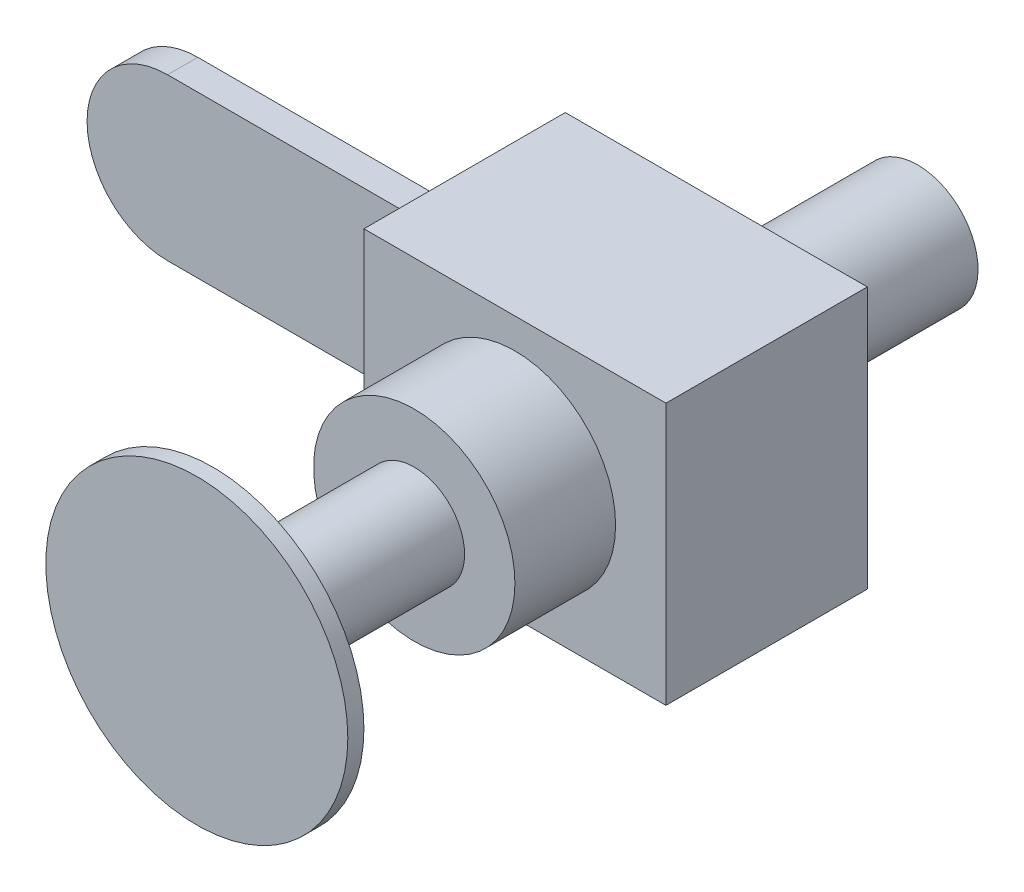
ISO-10303-21;
HEADER;
FILE_DESCRIPTION(('STEP AP214'),'2;1');
FILE_NAME('part.step','',(''),(''),'','','');
FILE_SCHEMA(('AUTOMOTIVE_DESIGN { 1 0 10303 214 1 1 1 1 }'));
ENDSEC;
DATA;
#1=APPLICATION_CONTEXT('core data for automotive mechanical design processes');
#2=APPLICATION_PROTOCOL_DEFINITION('international standard','automotive_design',2000,#1);
#3=PRODUCT_CONTEXT('',#1,'mechanical');
#4=PRODUCT('Part','Part','',(#3));
#5=PRODUCT_RELATED_PRODUCT_CATEGORY('part','',(#4));
#6=PRODUCT_DEFINITION_FORMATION('','',#4);
#7=PRODUCT_DEFINITION_CONTEXT('part definition',#1,'design');
#8=PRODUCT_DEFINITION('design','',#6,#7);
#9=PRODUCT_DEFINITION_SHAPE('','',#8);
#10=(LENGTH_UNIT() NAMED_UNIT(*) SI_UNIT(.MILLI.,.METRE.));
#11=(NAMED_UNIT(*) PLANE_ANGLE_UNIT() SI_UNIT($,.RADIAN.));
#12=(NAMED_UNIT(*) SI_UNIT($,.STERADIAN.) SOLID_ANGLE_UNIT());
#13=UNCERTAINTY_MEASURE_WITH_UNIT(LENGTH_MEASURE(1.E-05),#10,'distance_accuracy_value','');
#14=(GEOMETRIC_REPRESENTATION_CONTEXT(3) GLOBAL_UNCERTAINTY_ASSIGNED_CONTEXT((#13)) GLOBAL_UNIT_ASSIGNED_CONTEXT((#10,
#11,#12)) REPRESENTATION_CONTEXT('',''));
#15=CARTESIAN_POINT('',(0.,0.,0.));
#16=DIRECTION('',(0.,0.,1.));
#17=DIRECTION('',(1.,0.,0.));
#18=AXIS2_PLACEMENT_3D('',#15,#16,#17);
#19=CARTESIAN_POINT('',(0.,0.,7.5));
#20=DIRECTION('',(0.,0.,-1.));
#21=DIRECTION('',(-1.,0.,0.));
#22=AXIS2_PLACEMENT_3D('',#19,#20,#21);
#23=CYLINDRICAL_SURFACE('',#22,40.);
#24=CARTESIAN_POINT('',(0.,0.,-7.5));
#25=DIRECTION('',(0.,0.,1.));
#26=DIRECTION('',(1.,0.,0.));
#27=AXIS2_PLACEMENT_3D('',#24,#25,#26);
#28=CIRCLE('',#27,40.);
#29=CARTESIAN_POINT('',(0.,40.,-7.5));
#30=VERTEX_POINT('',#29);
#31=CARTESIAN_POINT('',(0.,-40.,-7.5));
#32=VERTEX_POINT('',#31);
#33=EDGE_CURVE('E136',#30,#32,#28,.T.);
#34=ORIENTED_EDGE('',*,*,#33,.T.);
#35=DIRECTION('',(0.,0.,-1.));
#36=VECTOR('',#35,1.);
#37=CARTESIAN_POINT('',(0.,-40.,7.5));
#38=LINE('',#37,#36);
#39=CARTESIAN_POINT('',(0.,-40.,7.5));
#40=VERTEX_POINT('',#39);
#41=EDGE_CURVE('E41',#40,#32,#38,.T.);
#42=ORIENTED_EDGE('',*,*,#41,.F.);
#43=CARTESIAN_POINT('',(0.,0.,7.5));
#44=DIRECTION('',(0.,0.,1.));
#45=DIRECTION('',(1.,0.,0.));
#46=AXIS2_PLACEMENT_3D('',#43,#44,#45);
#47=CIRCLE('',#46,40.);
#48=CARTESIAN_POINT('',(0.,40.,7.5));
#49=VERTEX_POINT('',#48);
#50=EDGE_CURVE('E145',#49,#40,#47,.T.);
#51=ORIENTED_EDGE('',*,*,#50,.F.);
#52=DIRECTION('',(0.,0.,-1.));
#53=VECTOR('',#52,1.);
#54=CARTESIAN_POINT('',(0.,40.,7.5));
#55=LINE('',#54,#53);
#56=EDGE_CURVE('E150',#49,#30,#55,.T.);
#57=ORIENTED_EDGE('',*,*,#56,.T.);
#58=EDGE_LOOP('',(#34,#42,#51,#57));
#59=FACE_BOUND('',#58,.T.);
#60=ADVANCED_FACE('F38',(#59),#23,.T.);
#61=CARTESIAN_POINT('',(140.,-40.,7.5));
#62=DIRECTION('',(0.,1.,0.));
#63=DIRECTION('',(-1.,0.,0.));
#64=AXIS2_PLACEMENT_3D('',#61,#62,#63);
#65=PLANE('',#64);
#66=DIRECTION('',(1.,0.,0.));
#67=VECTOR('',#66,1.);
#68=CARTESIAN_POINT('',(140.,-40.,-7.5));
#69=LINE('',#68,#67);
#70=CARTESIAN_POINT('',(140.,-40.,-7.5));
#71=VERTEX_POINT('',#70);
#72=EDGE_CURVE('E139',#32,#71,#69,.T.);
#73=ORIENTED_EDGE('',*,*,#72,.T.);
#74=DIRECTION('',(0.,0.,-1.));
#75=VECTOR('',#74,1.);
#76=CARTESIAN_POINT('',(140.,-40.,7.5));
#77=LINE('',#76,#75);
#78=CARTESIAN_POINT('',(140.,-40.,7.5));
#79=VERTEX_POINT('',#78);
#80=EDGE_CURVE('E159',#79,#71,#77,.T.);
#81=ORIENTED_EDGE('',*,*,#80,.F.);
#82=DIRECTION('',(1.,0.,0.));
#83=VECTOR('',#82,1.);
#84=CARTESIAN_POINT('',(140.,-40.,7.5));
#85=LINE('',#84,#83);
#86=EDGE_CURVE('E81',#40,#79,#85,.T.);
#87=ORIENTED_EDGE('',*,*,#86,.F.);
#88=ORIENTED_EDGE('',*,*,#41,.T.);
#89=EDGE_LOOP('',(#73,#81,#87,#88));
#90=FACE_BOUND('',#89,.T.);
#91=ADVANCED_FACE('F204',(#90),#65,.F.);
#92=CARTESIAN_POINT('',(0.,40.,7.5));
#93=DIRECTION('',(0.,-1.,0.));
#94=DIRECTION('',(1.,0.,0.));
#95=AXIS2_PLACEMENT_3D('',#92,#93,#94);
#96=PLANE('',#95);
#97=DIRECTION('',(-1.,0.,0.));
#98=VECTOR('',#97,1.);
#99=CARTESIAN_POINT('',(0.,40.,-7.5));
#100=LINE('',#99,#98);
#101=CARTESIAN_POINT('',(140.,40.,-7.5));
#102=VERTEX_POINT('',#101);
#103=EDGE_CURVE('E73',#102,#30,#100,.T.);
#104=ORIENTED_EDGE('',*,*,#103,.T.);
#105=ORIENTED_EDGE('',*,*,#56,.F.);
#106=DIRECTION('',(-1.,0.,0.));
#107=VECTOR('',#106,1.);
#108=CARTESIAN_POINT('',(0.,40.,7.5));
#109=LINE('',#108,#107);
#110=CARTESIAN_POINT('',(140.,40.,7.5));
#111=VERTEX_POINT('',#110);
#112=EDGE_CURVE('E56',#111,#49,#109,.T.);
#113=ORIENTED_EDGE('',*,*,#112,.F.);
#114=DIRECTION('',(0.,0.,-1.));
#115=VECTOR('',#114,1.);
#116=CARTESIAN_POINT('',(140.,40.,7.5));
#117=LINE('',#116,#115);
#118=EDGE_CURVE('E70',#111,#102,#117,.T.);
#119=ORIENTED_EDGE('',*,*,#118,.T.);
#120=EDGE_LOOP('',(#104,#105,#113,#119));
#121=FACE_BOUND('',#120,.T.);
#122=ADVANCED_FACE('F209',(#121),#96,.F.);
#123=CARTESIAN_POINT('',(0.,0.,7.5));
#124=DIRECTION('',(0.,0.,1.));
#125=DIRECTION('',(1.,0.,0.));
#126=AXIS2_PLACEMENT_3D('',#123,#124,#125);
#127=PLANE('',#126);
#128=ORIENTED_EDGE('',*,*,#50,.T.);
#129=ORIENTED_EDGE('',*,*,#86,.T.);
#130=DIRECTION('',(0.,1.,0.));
#131=VECTOR('',#130,1.);
#132=CARTESIAN_POINT('',(140.,40.,7.5));
#133=LINE('',#132,#131);
#134=EDGE_CURVE('E148',#79,#111,#133,.T.);
#135=ORIENTED_EDGE('',*,*,#134,.T.);
#136=ORIENTED_EDGE('',*,*,#112,.T.);
#137=EDGE_LOOP('',(#128,#129,#135,#136));
#138=FACE_BOUND('',#137,.T.);
#139=ADVANCED_FACE('F214',(#138),#127,.T.);
#140=CARTESIAN_POINT('',(0.,0.,-7.5));
#141=DIRECTION('',(0.,0.,1.));
#142=DIRECTION('',(1.,0.,0.));
#143=AXIS2_PLACEMENT_3D('',#140,#141,#142);
#144=PLANE('',#143);
#145=ORIENTED_EDGE('',*,*,#33,.F.);
#146=ORIENTED_EDGE('',*,*,#103,.F.);
#147=DIRECTION('',(0.,1.,0.));
#148=VECTOR('',#147,1.);
#149=CARTESIAN_POINT('',(140.,40.,-7.5));
#150=LINE('',#149,#148);
#151=EDGE_CURVE('E154',#71,#102,#150,.T.);
#152=ORIENTED_EDGE('',*,*,#151,.F.);
#153=ORIENTED_EDGE('',*,*,#72,.F.);
#154=EDGE_LOOP('',(#145,#146,#152,#153));
#155=FACE_BOUND('',#154,.T.);
#156=ADVANCED_FACE('F213',(#155),#144,.F.);
#157=CARTESIAN_POINT('',(140.,0.,0.));
#158=DIRECTION('',(1.,0.,0.));
#159=DIRECTION('',(0.,0.,-1.));
#160=AXIS2_PLACEMENT_3D('',#157,#158,#159);
#161=PLANE('',#160);
#162=DIRECTION('',(0.,1.,0.));
#163=VECTOR('',#162,1.);
#164=CARTESIAN_POINT('',(140.,65.,-50.));
#165=LINE('',#164,#163);
#166=CARTESIAN_POINT('',(140.,-65.,-50.));
#167=VERTEX_POINT('',#166);
#168=CARTESIAN_POINT('',(140.,65.,-50.));
#169=VERTEX_POINT('',#168);
#170=EDGE_CURVE('E135',#167,#169,#165,.T.);
#171=ORIENTED_EDGE('',*,*,#170,.F.);
#172=DIRECTION('',(0.,0.,-1.));
#173=VECTOR('',#172,1.);
#174=CARTESIAN_POINT('',(140.,-65.,50.));
#175=LINE('',#174,#173);
#176=CARTESIAN_POINT('',(140.,-65.,50.));
#177=VERTEX_POINT('',#176);
#178=EDGE_CURVE('E131',#177,#167,#175,.T.);
#179=ORIENTED_EDGE('',*,*,#178,.F.);
#180=DIRECTION('',(0.,-1.,0.));
#181=VECTOR('',#180,1.);
#182=CARTESIAN_POINT('',(140.,65.,50.));
#183=LINE('',#182,#181);
#184=CARTESIAN_POINT('',(140.,65.,50.));
#185=VERTEX_POINT('',#184);
#186=EDGE_CURVE('E180',#185,#177,#183,.T.);
#187=ORIENTED_EDGE('',*,*,#186,.F.);
#188=DIRECTION('',(0.,0.,1.));
#189=VECTOR('',#188,1.);
#190=CARTESIAN_POINT('',(140.,65.,50.));
#191=LINE('',#190,#189);
#192=EDGE_CURVE('E178',#169,#185,#191,.T.);
#193=ORIENTED_EDGE('',*,*,#192,.F.);
#194=EDGE_LOOP('',(#171,#179,#187,#193));
#195=FACE_BOUND('',#194,.T.);
#196=ORIENTED_EDGE('',*,*,#80,.T.);
#197=ORIENTED_EDGE('',*,*,#151,.T.);
#198=ORIENTED_EDGE('',*,*,#118,.F.);
#199=ORIENTED_EDGE('',*,*,#134,.F.);
#200=EDGE_LOOP('',(#196,#197,#198,#199));
#201=FACE_BOUND('',#200,.T.);
#202=ADVANCED_FACE('F191',(#195,#201),#161,.F.);
#203=CARTESIAN_POINT('',(290.,65.,-50.));
#204=DIRECTION('',(0.,0.,1.));
#205=DIRECTION('',(0.,-1.,0.));
#206=AXIS2_PLACEMENT_3D('',#203,#204,#205);
#207=PLANE('',#206);
#208=CARTESIAN_POINT('',(215.,0.,-50.));
#209=DIRECTION('',(0.,0.,-1.));
#210=DIRECTION('',(0.,1.,0.));
#211=AXIS2_PLACEMENT_3D('',#208,#209,#210);
#212=CIRCLE('',#211,30.);
#213=CARTESIAN_POINT('',(215.,30.,-50.));
#214=VERTEX_POINT('',#213);
#215=EDGE_CURVE('E163',#214,#214,#212,.T.);
#216=ORIENTED_EDGE('',*,*,#215,.F.);
#217=EDGE_LOOP('',(#216));
#218=FACE_BOUND('',#217,.T.);
#219=ORIENTED_EDGE('',*,*,#170,.T.);
#220=DIRECTION('',(-1.,0.,0.));
#221=VECTOR('',#220,1.);
#222=CARTESIAN_POINT('',(290.,65.,-50.));
#223=LINE('',#222,#221);
#224=CARTESIAN_POINT('',(290.,65.,-50.));
#225=VERTEX_POINT('',#224);
#226=EDGE_CURVE('E115',#225,#169,#223,.T.);
#227=ORIENTED_EDGE('',*,*,#226,.F.);
#228=DIRECTION('',(0.,1.,0.));
#229=VECTOR('',#228,1.);
#230=CARTESIAN_POINT('',(290.,65.,-50.));
#231=LINE('',#230,#229);
#232=CARTESIAN_POINT('',(290.,-65.,-50.));
#233=VERTEX_POINT('',#232);
#234=EDGE_CURVE('E122',#233,#225,#231,.T.);
#235=ORIENTED_EDGE('',*,*,#234,.F.);
#236=DIRECTION('',(-1.,0.,0.));
#237=VECTOR('',#236,1.);
#238=CARTESIAN_POINT('',(290.,-65.,-50.));
#239=LINE('',#238,#237);
#240=EDGE_CURVE('E176',#233,#167,#239,.T.);
#241=ORIENTED_EDGE('',*,*,#240,.T.);
#242=EDGE_LOOP('',(#219,#227,#235,#241));
#243=FACE_BOUND('',#242,.T.);
#244=ADVANCED_FACE('F133',(#218,#243),#207,.F.);
#245=CARTESIAN_POINT('',(290.,65.,50.));
#246=DIRECTION('',(0.,-1.,0.));
#247=DIRECTION('',(0.,0.,-1.));
#248=AXIS2_PLACEMENT_3D('',#245,#246,#247);
#249=PLANE('',#248);
#250=ORIENTED_EDGE('',*,*,#192,.T.);
#251=DIRECTION('',(-1.,0.,0.));
#252=VECTOR('',#251,1.);
#253=CARTESIAN_POINT('',(290.,65.,50.));
#254=LINE('',#253,#252);
#255=CARTESIAN_POINT('',(290.,65.,50.));
#256=VERTEX_POINT('',#255);
#257=EDGE_CURVE('E118',#256,#185,#254,.T.);
#258=ORIENTED_EDGE('',*,*,#257,.F.);
#259=DIRECTION('',(0.,0.,1.));
#260=VECTOR('',#259,1.);
#261=CARTESIAN_POINT('',(290.,65.,50.));
#262=LINE('',#261,#260);
#263=EDGE_CURVE('E111',#225,#256,#262,.T.);
#264=ORIENTED_EDGE('',*,*,#263,.F.);
#265=ORIENTED_EDGE('',*,*,#226,.T.);
#266=EDGE_LOOP('',(#250,#258,#264,#265));
#267=FACE_BOUND('',#266,.T.);
#268=ADVANCED_FACE('F113',(#267),#249,.F.);
#269=CARTESIAN_POINT('',(290.,65.,50.));
#270=DIRECTION('',(0.,0.,-1.));
#271=DIRECTION('',(0.,1.,0.));
#272=AXIS2_PLACEMENT_3D('',#269,#270,#271);
#273=PLANE('',#272);
#274=CARTESIAN_POINT('',(215.,0.,50.));
#275=DIRECTION('',(0.,0.,1.));
#276=DIRECTION('',(1.,0.,0.));
#277=AXIS2_PLACEMENT_3D('',#274,#275,#276);
#278=CIRCLE('',#277,50.);
#279=CARTESIAN_POINT('',(265.,0.,50.));
#280=VERTEX_POINT('',#279);
#281=EDGE_CURVE('E47',#280,#280,#278,.T.);
#282=ORIENTED_EDGE('',*,*,#281,.F.);
#283=EDGE_LOOP('',(#282));
#284=FACE_BOUND('',#283,.T.);
#285=ORIENTED_EDGE('',*,*,#186,.T.);
#286=DIRECTION('',(-1.,0.,0.));
#287=VECTOR('',#286,1.);
#288=CARTESIAN_POINT('',(290.,-65.,50.));
#289=LINE('',#288,#287);
#290=CARTESIAN_POINT('',(290.,-65.,50.));
#291=VERTEX_POINT('',#290);
#292=EDGE_CURVE('E141',#291,#177,#289,.T.);
#293=ORIENTED_EDGE('',*,*,#292,.F.);
#294=DIRECTION('',(0.,-1.,0.));
#295=VECTOR('',#294,1.);
#296=CARTESIAN_POINT('',(290.,65.,50.));
#297=LINE('',#296,#295);
#298=EDGE_CURVE('E121',#256,#291,#297,.T.);
#299=ORIENTED_EDGE('',*,*,#298,.F.);
#300=ORIENTED_EDGE('',*,*,#257,.T.);
#301=EDGE_LOOP('',(#285,#293,#299,#300));
#302=FACE_BOUND('',#301,.T.);
#303=ADVANCED_FACE('F192',(#284,#302),#273,.F.);
#304=CARTESIAN_POINT('',(290.,-65.,50.));
#305=DIRECTION('',(0.,1.,0.));
#306=DIRECTION('',(0.,0.,1.));
#307=AXIS2_PLACEMENT_3D('',#304,#305,#306);
#308=PLANE('',#307);
#309=ORIENTED_EDGE('',*,*,#178,.T.);
#310=ORIENTED_EDGE('',*,*,#240,.F.);
#311=DIRECTION('',(0.,0.,-1.));
#312=VECTOR('',#311,1.);
#313=CARTESIAN_POINT('',(290.,-65.,50.));
#314=LINE('',#313,#312);
#315=EDGE_CURVE('E127',#291,#233,#314,.T.);
#316=ORIENTED_EDGE('',*,*,#315,.F.);
#317=ORIENTED_EDGE('',*,*,#292,.T.);
#318=EDGE_LOOP('',(#309,#310,#316,#317));
#319=FACE_BOUND('',#318,.T.);
#320=ADVANCED_FACE('F187',(#319),#308,.F.);
#321=CARTESIAN_POINT('',(290.,0.,0.));
#322=DIRECTION('',(1.,0.,0.));
#323=DIRECTION('',(0.,0.,-1.));
#324=AXIS2_PLACEMENT_3D('',#321,#322,#323);
#325=PLANE('',#324);
#326=ORIENTED_EDGE('',*,*,#234,.T.);
#327=ORIENTED_EDGE('',*,*,#263,.T.);
#328=ORIENTED_EDGE('',*,*,#298,.T.);
#329=ORIENTED_EDGE('',*,*,#315,.T.);
#330=EDGE_LOOP('',(#326,#327,#328,#329));
#331=FACE_BOUND('',#330,.T.);
#332=ADVANCED_FACE('F125',(#331),#325,.T.);
#333=CARTESIAN_POINT('',(215.,0.,-150.));
#334=DIRECTION('',(0.,0.,1.));
#335=DIRECTION('',(0.,-1.,0.));
#336=AXIS2_PLACEMENT_3D('',#333,#334,#335);
#337=CYLINDRICAL_SURFACE('',#336,30.);
#338=CARTESIAN_POINT('',(215.,0.,-150.));
#339=DIRECTION('',(0.,0.,-1.));
#340=DIRECTION('',(0.,1.,0.));
#341=AXIS2_PLACEMENT_3D('',#338,#339,#340);
#342=CIRCLE('',#341,30.);
#343=CARTESIAN_POINT('',(215.,30.,-150.));
#344=VERTEX_POINT('',#343);
#345=EDGE_CURVE('E172',#344,#344,#342,.T.);
#346=ORIENTED_EDGE('',*,*,#345,.F.);
#347=EDGE_LOOP('',(#346));
#348=FACE_BOUND('',#347,.T.);
#349=ORIENTED_EDGE('',*,*,#215,.T.);
#350=EDGE_LOOP('',(#349));
#351=FACE_BOUND('',#350,.T.);
#352=ADVANCED_FACE('F235',(#348,#351),#337,.T.);
#353=CARTESIAN_POINT('',(215.,0.,-150.));
#354=DIRECTION('',(0.,0.,-1.));
#355=DIRECTION('',(0.,1.,0.));
#356=AXIS2_PLACEMENT_3D('',#353,#354,#355);
#357=PLANE('',#356);
#358=ORIENTED_EDGE('',*,*,#345,.T.);
#359=EDGE_LOOP('',(#358));
#360=FACE_BOUND('',#359,.T.);
#361=ADVANCED_FACE('F238',(#360),#357,.T.);
#362=CARTESIAN_POINT('',(215.,0.,100.));
#363=DIRECTION('',(0.,0.,-1.));
#364=DIRECTION('',(-1.,0.,0.));
#365=AXIS2_PLACEMENT_3D('',#362,#363,#364);
#366=CYLINDRICAL_SURFACE('',#365,50.);
#367=CARTESIAN_POINT('',(215.,0.,100.));
#368=DIRECTION('',(0.,0.,1.));
#369=DIRECTION('',(1.,0.,0.));
#370=AXIS2_PLACEMENT_3D('',#367,#368,#369);
#371=CIRCLE('',#370,50.);
#372=CARTESIAN_POINT('',(265.,0.,100.));
#373=VERTEX_POINT('',#372);
#374=EDGE_CURVE('E275',#373,#373,#371,.T.);
#375=ORIENTED_EDGE('',*,*,#374,.F.);
#376=EDGE_LOOP('',(#375));
#377=FACE_BOUND('',#376,.T.);
#378=ORIENTED_EDGE('',*,*,#281,.T.);
#379=EDGE_LOOP('',(#378));
#380=FACE_BOUND('',#379,.T.);
#381=ADVANCED_FACE('F242',(#377,#380),#366,.T.);
#382=CARTESIAN_POINT('',(215.,0.,100.));
#383=DIRECTION('',(0.,0.,1.));
#384=DIRECTION('',(1.,0.,0.));
#385=AXIS2_PLACEMENT_3D('',#382,#383,#384);
#386=PLANE('',#385);
#387=CARTESIAN_POINT('',(215.,0.,100.));
#388=DIRECTION('',(0.,0.,1.));
#389=DIRECTION('',(1.,0.,0.));
#390=AXIS2_PLACEMENT_3D('',#387,#388,#389);
#391=CIRCLE('',#390,25.);
#392=CARTESIAN_POINT('',(240.,0.,100.));
#393=VERTEX_POINT('',#392);
#394=EDGE_CURVE('E11',#393,#393,#391,.T.);
#395=ORIENTED_EDGE('',*,*,#394,.F.);
#396=EDGE_LOOP('',(#395));
#397=FACE_BOUND('',#396,.T.);
#398=ORIENTED_EDGE('',*,*,#374,.T.);
#399=EDGE_LOOP('',(#398));
#400=FACE_BOUND('',#399,.T.);
#401=ADVANCED_FACE('F246',(#397,#400),#386,.T.);
#402=CARTESIAN_POINT('',(215.,0.,200.));
#403=DIRECTION('',(0.,0.,-1.));
#404=DIRECTION('',(-1.,0.,0.));
#405=AXIS2_PLACEMENT_3D('',#402,#403,#404);
#406=CYLINDRICAL_SURFACE('',#405,25.);
#407=CARTESIAN_POINT('',(215.,0.,200.));
#408=DIRECTION('',(0.,0.,1.));
#409=DIRECTION('',(1.,0.,0.));
#410=AXIS2_PLACEMENT_3D('',#407,#408,#409);
#411=CIRCLE('',#410,25.);
#412=CARTESIAN_POINT('',(240.,0.,200.));
#413=VERTEX_POINT('',#412);
#414=EDGE_CURVE('E271',#413,#413,#411,.T.);
#415=ORIENTED_EDGE('',*,*,#414,.F.);
#416=EDGE_LOOP('',(#415));
#417=FACE_BOUND('',#416,.T.);
#418=ORIENTED_EDGE('',*,*,#394,.T.);
#419=EDGE_LOOP('',(#418));
#420=FACE_BOUND('',#419,.T.);
#421=ADVANCED_FACE('F250',(#417,#420),#406,.T.);
#422=CARTESIAN_POINT('',(215.,0.,208.));
#423=DIRECTION('',(0.,0.,-1.));
#424=DIRECTION('',(-1.,0.,0.));
#425=AXIS2_PLACEMENT_3D('',#422,#423,#424);
#426=CYLINDRICAL_SURFACE('',#425,75.);
#427=CARTESIAN_POINT('',(215.,0.,208.));
#428=DIRECTION('',(0.,0.,1.));
#429=DIRECTION('',(1.,0.,0.));
#430=AXIS2_PLACEMENT_3D('',#427,#428,#429);
#431=CIRCLE('',#430,75.);
#432=CARTESIAN_POINT('',(290.,0.,208.));
#433=VERTEX_POINT('',#432);
#434=EDGE_CURVE('E270',#433,#433,#431,.T.);
#435=ORIENTED_EDGE('',*,*,#434,.F.);
#436=EDGE_LOOP('',(#435));
#437=FACE_BOUND('',#436,.T.);
#438=CARTESIAN_POINT('',(215.,0.,200.));
#439=DIRECTION('',(0.,0.,1.));
#440=DIRECTION('',(1.,0.,0.));
#441=AXIS2_PLACEMENT_3D('',#438,#439,#440);
#442=CIRCLE('',#441,75.);
#443=CARTESIAN_POINT('',(290.,0.,200.));
#444=VERTEX_POINT('',#443);
#445=EDGE_CURVE('E272',#444,#444,#442,.T.);
#446=ORIENTED_EDGE('',*,*,#445,.T.);
#447=EDGE_LOOP('',(#446));
#448=FACE_BOUND('',#447,.T.);
#449=ADVANCED_FACE('F254',(#437,#448),#426,.T.);
#450=CARTESIAN_POINT('',(215.,0.,208.));
#451=DIRECTION('',(0.,0.,1.));
#452=DIRECTION('',(1.,0.,0.));
#453=AXIS2_PLACEMENT_3D('',#450,#451,#452);
#454=PLANE('',#453);
#455=ORIENTED_EDGE('',*,*,#434,.T.);
#456=EDGE_LOOP('',(#455));
#457=FACE_BOUND('',#456,.T.);
#458=ADVANCED_FACE('F258',(#457),#454,.T.);
#459=CARTESIAN_POINT('',(215.,0.,200.));
#460=DIRECTION('',(0.,0.,1.));
#461=DIRECTION('',(1.,0.,0.));
#462=AXIS2_PLACEMENT_3D('',#459,#460,#461);
#463=PLANE('',#462);
#464=ORIENTED_EDGE('',*,*,#414,.T.);
#465=EDGE_LOOP('',(#464));
#466=FACE_BOUND('',#465,.T.);
#467=ORIENTED_EDGE('',*,*,#445,.F.);
#468=EDGE_LOOP('',(#467));
#469=FACE_BOUND('',#468,.T.);
#470=ADVANCED_FACE('F260',(#466,#469),#463,.F.);
#471=CLOSED_SHELL('',(#60,#91,#122,#139,#156,#202,#244,#268,#303,#320,#332,#352,#361,#381,#401,
#421,#449,#458,#470));
#472=MANIFOLD_SOLID_BREP('B2',#471);
#473=ADVANCED_BREP_SHAPE_REPRESENTATION('',(#18,#472),#14);
#474=SHAPE_DEFINITION_REPRESENTATION(#9,#473);
ENDSEC;
END-ISO-10303-21;
